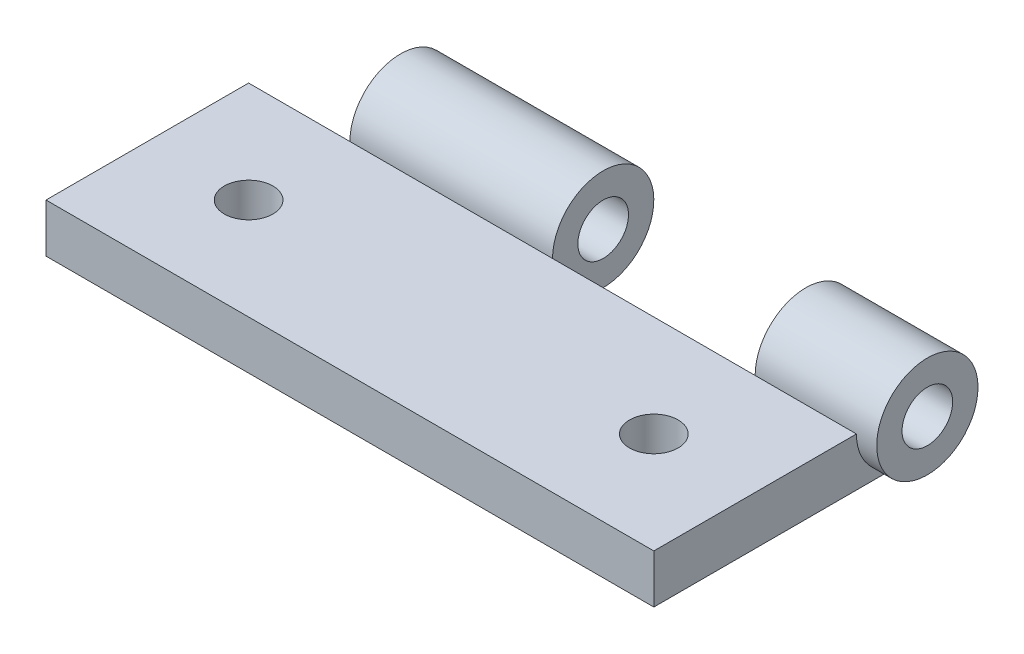
ISO-10303-21;
HEADER;
FILE_DESCRIPTION(('STEP AP214'),'2;1');
FILE_NAME('part.step','',(''),(''),'','','');
FILE_SCHEMA(('AUTOMOTIVE_DESIGN { 1 0 10303 214 1 1 1 1 }'));
ENDSEC;
DATA;
#1=APPLICATION_CONTEXT('core data for automotive mechanical design processes');
#2=APPLICATION_PROTOCOL_DEFINITION('international standard','automotive_design',2000,#1);
#3=PRODUCT_CONTEXT('',#1,'mechanical');
#4=PRODUCT('Part','Part','',(#3));
#5=PRODUCT_RELATED_PRODUCT_CATEGORY('part','',(#4));
#6=PRODUCT_DEFINITION_FORMATION('','',#4);
#7=PRODUCT_DEFINITION_CONTEXT('part definition',#1,'design');
#8=PRODUCT_DEFINITION('design','',#6,#7);
#9=PRODUCT_DEFINITION_SHAPE('','',#8);
#10=(LENGTH_UNIT() NAMED_UNIT(*) SI_UNIT(.MILLI.,.METRE.));
#11=(NAMED_UNIT(*) PLANE_ANGLE_UNIT() SI_UNIT($,.RADIAN.));
#12=(NAMED_UNIT(*) SI_UNIT($,.STERADIAN.) SOLID_ANGLE_UNIT());
#13=UNCERTAINTY_MEASURE_WITH_UNIT(LENGTH_MEASURE(1.E-05),#10,'distance_accuracy_value','');
#14=(GEOMETRIC_REPRESENTATION_CONTEXT(3) GLOBAL_UNCERTAINTY_ASSIGNED_CONTEXT((#13)) GLOBAL_UNIT_ASSIGNED_CONTEXT((#10,
#11,#12)) REPRESENTATION_CONTEXT('',''));
#15=CARTESIAN_POINT('',(0.,0.,0.));
#16=DIRECTION('',(0.,0.,1.));
#17=DIRECTION('',(1.,0.,0.));
#18=AXIS2_PLACEMENT_3D('',#15,#16,#17);
#19=CARTESIAN_POINT('',(0.,0.,0.));
#20=DIRECTION('',(0.,-1.,0.));
#21=DIRECTION('',(0.,0.,-1.));
#22=AXIS2_PLACEMENT_3D('',#19,#20,#21);
#23=PLANE('',#22);
#24=CARTESIAN_POINT('',(12.7,0.,1.5875));
#25=DIRECTION('',(0.,-1.,0.));
#26=DIRECTION('',(0.,0.,-1.));
#27=AXIS2_PLACEMENT_3D('',#24,#25,#26);
#28=CIRCLE('',#27,1.524);
#29=CARTESIAN_POINT('',(12.7,0.,0.0635000000000015));
#30=VERTEX_POINT('',#29);
#31=EDGE_CURVE('E178',#30,#30,#28,.T.);
#32=ORIENTED_EDGE('',*,*,#31,.F.);
#33=EDGE_LOOP('',(#32));
#34=FACE_BOUND('',#33,.T.);
#35=CARTESIAN_POINT('',(-12.7,0.,1.5875));
#36=DIRECTION('',(0.,-1.,0.));
#37=DIRECTION('',(0.,0.,-1.));
#38=AXIS2_PLACEMENT_3D('',#35,#36,#37);
#39=CIRCLE('',#38,1.524);
#40=CARTESIAN_POINT('',(-12.7,0.,0.0635));
#41=VERTEX_POINT('',#40);
#42=EDGE_CURVE('E172',#41,#41,#39,.T.);
#43=ORIENTED_EDGE('',*,*,#42,.F.);
#44=EDGE_LOOP('',(#43));
#45=FACE_BOUND('',#44,.T.);
#46=DIRECTION('',(1.,0.,0.));
#47=VECTOR('',#46,1.);
#48=CARTESIAN_POINT('',(-20.32,0.,-7.04849999999999));
#49=LINE('',#48,#47);
#50=CARTESIAN_POINT('',(0.,0.,-7.0485));
#51=VERTEX_POINT('',#50);
#52=CARTESIAN_POINT('',(-12.7,0.,-7.0485));
#53=VERTEX_POINT('',#52);
#54=EDGE_CURVE('E246',#51,#53,#49,.F.);
#55=ORIENTED_EDGE('',*,*,#54,.F.);
#56=DIRECTION('',(0.,0.,1.));
#57=VECTOR('',#56,1.);
#58=CARTESIAN_POINT('',(0.,0.,0.));
#59=LINE('',#58,#57);
#60=CARTESIAN_POINT('',(0.,0.,-4.7625));
#61=VERTEX_POINT('',#60);
#62=EDGE_CURVE('E157',#51,#61,#59,.T.);
#63=ORIENTED_EDGE('',*,*,#62,.T.);
#64=DIRECTION('',(-1.,0.,0.));
#65=VECTOR('',#64,1.);
#66=CARTESIAN_POINT('',(0.,0.,-4.7625));
#67=LINE('',#66,#65);
#68=CARTESIAN_POINT('',(12.7,0.,-4.7625));
#69=VERTEX_POINT('',#68);
#70=EDGE_CURVE('E160',#69,#61,#67,.T.);
#71=ORIENTED_EDGE('',*,*,#70,.F.);
#72=DIRECTION('',(0.,0.,1.));
#73=VECTOR('',#72,1.);
#74=CARTESIAN_POINT('',(12.7,0.,0.));
#75=LINE('',#74,#73);
#76=CARTESIAN_POINT('',(12.7,0.,-7.0485));
#77=VERTEX_POINT('',#76);
#78=EDGE_CURVE('E129',#77,#69,#75,.T.);
#79=ORIENTED_EDGE('',*,*,#78,.F.);
#80=CARTESIAN_POINT('',(19.05,0.,-7.0485));
#81=VERTEX_POINT('',#80);
#82=EDGE_CURVE('E58',#81,#77,#49,.F.);
#83=ORIENTED_EDGE('',*,*,#82,.F.);
#84=DIRECTION('',(0.,0.,-1.));
#85=VECTOR('',#84,1.);
#86=CARTESIAN_POINT('',(19.05,0.,7.9375));
#87=LINE('',#86,#85);
#88=CARTESIAN_POINT('',(19.05,0.,7.9375));
#89=VERTEX_POINT('',#88);
#90=EDGE_CURVE('E134',#89,#81,#87,.T.);
#91=ORIENTED_EDGE('',*,*,#90,.F.);
#92=DIRECTION('',(1.,0.,0.));
#93=VECTOR('',#92,1.);
#94=CARTESIAN_POINT('',(-19.05,0.,7.9375));
#95=LINE('',#94,#93);
#96=CARTESIAN_POINT('',(-19.05,0.,7.9375));
#97=VERTEX_POINT('',#96);
#98=EDGE_CURVE('E239',#97,#89,#95,.T.);
#99=ORIENTED_EDGE('',*,*,#98,.F.);
#100=DIRECTION('',(0.,0.,1.));
#101=VECTOR('',#100,1.);
#102=CARTESIAN_POINT('',(-19.05,0.,7.9375));
#103=LINE('',#102,#101);
#104=CARTESIAN_POINT('',(-19.05,0.,-4.7625));
#105=VERTEX_POINT('',#104);
#106=EDGE_CURVE('E135',#105,#97,#103,.T.);
#107=ORIENTED_EDGE('',*,*,#106,.F.);
#108=DIRECTION('',(-1.,0.,0.));
#109=VECTOR('',#108,1.);
#110=CARTESIAN_POINT('',(0.,0.,-4.76250000000001));
#111=LINE('',#110,#109);
#112=CARTESIAN_POINT('',(-12.7,0.,-4.7625));
#113=VERTEX_POINT('',#112);
#114=EDGE_CURVE('E147',#113,#105,#111,.T.);
#115=ORIENTED_EDGE('',*,*,#114,.F.);
#116=DIRECTION('',(0.,0.,1.));
#117=VECTOR('',#116,1.);
#118=CARTESIAN_POINT('',(-12.7,0.,0.));
#119=LINE('',#118,#117);
#120=EDGE_CURVE('E143',#53,#113,#119,.T.);
#121=ORIENTED_EDGE('',*,*,#120,.F.);
#122=EDGE_LOOP('',(#55,#63,#71,#79,#83,#91,#99,#107,#115,#121));
#123=FACE_BOUND('',#122,.T.);
#124=ADVANCED_FACE('F34',(#34,#45,#123),#23,.T.);
#125=CARTESIAN_POINT('',(-20.32,3.048,-7.9375));
#126=DIRECTION('',(1.,0.,0.));
#127=DIRECTION('',(0.,0.,-1.));
#128=AXIS2_PLACEMENT_3D('',#125,#126,#127);
#129=CYLINDRICAL_SURFACE('',#128,3.175);
#130=DIRECTION('',(1.,0.,0.));
#131=VECTOR('',#130,1.);
#132=CARTESIAN_POINT('',(-20.32,3.048,-4.7625));
#133=LINE('',#132,#131);
#134=CARTESIAN_POINT('',(0.,3.048,-4.7625));
#135=VERTEX_POINT('',#134);
#136=CARTESIAN_POINT('',(-12.7,3.048,-4.7625));
#137=VERTEX_POINT('',#136);
#138=EDGE_CURVE('E126',#135,#137,#133,.F.);
#139=ORIENTED_EDGE('',*,*,#138,.F.);
#140=CARTESIAN_POINT('',(0.,3.048,-7.9375));
#141=DIRECTION('',(1.,0.,0.));
#142=DIRECTION('',(0.,0.,-1.));
#143=AXIS2_PLACEMENT_3D('',#140,#141,#142);
#144=CIRCLE('',#143,3.175);
#145=EDGE_CURVE('E11',#135,#51,#144,.F.);
#146=ORIENTED_EDGE('',*,*,#145,.T.);
#147=ORIENTED_EDGE('',*,*,#54,.T.);
#148=CARTESIAN_POINT('',(-12.7,3.048,-7.9375));
#149=DIRECTION('',(1.,0.,0.));
#150=DIRECTION('',(0.,0.,-1.));
#151=AXIS2_PLACEMENT_3D('',#148,#149,#150);
#152=CIRCLE('',#151,3.175);
#153=EDGE_CURVE('E112',#137,#53,#152,.F.);
#154=ORIENTED_EDGE('',*,*,#153,.F.);
#155=EDGE_LOOP('',(#139,#146,#147,#154));
#156=FACE_BOUND('',#155,.T.);
#157=ADVANCED_FACE('F209',(#156),#129,.T.);
#158=CARTESIAN_POINT('',(12.7,3.048,-7.9375));
#159=DIRECTION('',(1.,0.,0.));
#160=DIRECTION('',(0.,0.,-1.));
#161=AXIS2_PLACEMENT_3D('',#158,#159,#160);
#162=CIRCLE('',#161,3.175);
#163=CARTESIAN_POINT('',(12.7,3.048,-4.7625));
#164=VERTEX_POINT('',#163);
#165=EDGE_CURVE('E43',#164,#77,#162,.F.);
#166=ORIENTED_EDGE('',*,*,#165,.F.);
#167=CARTESIAN_POINT('',(19.05,3.048,-4.7625));
#168=VERTEX_POINT('',#167);
#169=EDGE_CURVE('E109',#168,#164,#133,.F.);
#170=ORIENTED_EDGE('',*,*,#169,.F.);
#171=CARTESIAN_POINT('',(19.05,3.048,-7.9375));
#172=DIRECTION('',(-1.,0.,0.));
#173=DIRECTION('',(0.,0.,1.));
#174=AXIS2_PLACEMENT_3D('',#171,#172,#173);
#175=CIRCLE('',#174,3.175);
#176=EDGE_CURVE('E50',#81,#168,#175,.T.);
#177=ORIENTED_EDGE('',*,*,#176,.F.);
#178=ORIENTED_EDGE('',*,*,#82,.T.);
#179=EDGE_LOOP('',(#166,#170,#177,#178));
#180=FACE_BOUND('',#179,.T.);
#181=CARTESIAN_POINT('',(20.32,3.048,-7.9375));
#182=DIRECTION('',(1.,0.,0.));
#183=DIRECTION('',(0.,0.,-1.));
#184=AXIS2_PLACEMENT_3D('',#181,#182,#183);
#185=CIRCLE('',#184,3.175);
#186=CARTESIAN_POINT('',(20.32,3.048,-11.1125));
#187=VERTEX_POINT('',#186);
#188=EDGE_CURVE('E141',#187,#187,#185,.T.);
#189=ORIENTED_EDGE('',*,*,#188,.F.);
#190=EDGE_LOOP('',(#189));
#191=FACE_BOUND('',#190,.T.);
#192=ADVANCED_FACE('F106',(#180,#191),#129,.T.);
#193=CARTESIAN_POINT('',(19.05,3.048,7.9375));
#194=DIRECTION('',(-1.,0.,0.));
#195=DIRECTION('',(0.,0.,1.));
#196=AXIS2_PLACEMENT_3D('',#193,#194,#195);
#197=PLANE('',#196);
#198=ORIENTED_EDGE('',*,*,#90,.T.);
#199=ORIENTED_EDGE('',*,*,#176,.T.);
#200=DIRECTION('',(0.,0.,-1.));
#201=VECTOR('',#200,1.);
#202=CARTESIAN_POINT('',(19.05,3.048,7.9375));
#203=LINE('',#202,#201);
#204=CARTESIAN_POINT('',(19.05,3.048,7.9375));
#205=VERTEX_POINT('',#204);
#206=EDGE_CURVE('E133',#205,#168,#203,.T.);
#207=ORIENTED_EDGE('',*,*,#206,.F.);
#208=DIRECTION('',(0.,-1.,0.));
#209=VECTOR('',#208,1.);
#210=CARTESIAN_POINT('',(19.05,3.048,7.9375));
#211=LINE('',#210,#209);
#212=EDGE_CURVE('E237',#205,#89,#211,.T.);
#213=ORIENTED_EDGE('',*,*,#212,.T.);
#214=EDGE_LOOP('',(#198,#199,#207,#213));
#215=FACE_BOUND('',#214,.T.);
#216=ADVANCED_FACE('F36',(#215),#197,.F.);
#217=CARTESIAN_POINT('',(-19.05,3.048,7.9375));
#218=DIRECTION('',(1.,0.,0.));
#219=DIRECTION('',(0.,0.,-1.));
#220=AXIS2_PLACEMENT_3D('',#217,#218,#219);
#221=PLANE('',#220);
#222=DIRECTION('',(0.,0.,1.));
#223=VECTOR('',#222,1.);
#224=CARTESIAN_POINT('',(-19.05,3.048,7.9375));
#225=LINE('',#224,#223);
#226=CARTESIAN_POINT('',(-19.05,3.048,-4.7625));
#227=VERTEX_POINT('',#226);
#228=CARTESIAN_POINT('',(-19.05,3.048,7.9375));
#229=VERTEX_POINT('',#228);
#230=EDGE_CURVE('E230',#227,#229,#225,.T.);
#231=ORIENTED_EDGE('',*,*,#230,.F.);
#232=DIRECTION('',(0.,-1.,0.));
#233=VECTOR('',#232,1.);
#234=CARTESIAN_POINT('',(-19.05,3.048,-4.7625));
#235=LINE('',#234,#233);
#236=EDGE_CURVE('E149',#227,#105,#235,.T.);
#237=ORIENTED_EDGE('',*,*,#236,.T.);
#238=ORIENTED_EDGE('',*,*,#106,.T.);
#239=DIRECTION('',(0.,-1.,0.));
#240=VECTOR('',#239,1.);
#241=CARTESIAN_POINT('',(-19.05,3.048,7.9375));
#242=LINE('',#241,#240);
#243=EDGE_CURVE('E233',#229,#97,#242,.T.);
#244=ORIENTED_EDGE('',*,*,#243,.F.);
#245=EDGE_LOOP('',(#231,#237,#238,#244));
#246=FACE_BOUND('',#245,.T.);
#247=ADVANCED_FACE('F221',(#246),#221,.F.);
#248=CARTESIAN_POINT('',(-19.05,3.048,7.9375));
#249=DIRECTION('',(0.,0.,-1.));
#250=DIRECTION('',(-1.,0.,0.));
#251=AXIS2_PLACEMENT_3D('',#248,#249,#250);
#252=PLANE('',#251);
#253=ORIENTED_EDGE('',*,*,#98,.T.);
#254=ORIENTED_EDGE('',*,*,#212,.F.);
#255=DIRECTION('',(1.,0.,0.));
#256=VECTOR('',#255,1.);
#257=CARTESIAN_POINT('',(-19.05,3.048,7.9375));
#258=LINE('',#257,#256);
#259=EDGE_CURVE('E235',#229,#205,#258,.T.);
#260=ORIENTED_EDGE('',*,*,#259,.F.);
#261=ORIENTED_EDGE('',*,*,#243,.T.);
#262=EDGE_LOOP('',(#253,#254,#260,#261));
#263=FACE_BOUND('',#262,.T.);
#264=ADVANCED_FACE('F190',(#263),#252,.F.);
#265=CARTESIAN_POINT('',(0.,3.048,0.));
#266=DIRECTION('',(0.,-1.,0.));
#267=DIRECTION('',(0.,0.,-1.));
#268=AXIS2_PLACEMENT_3D('',#265,#266,#267);
#269=PLANE('',#268);
#270=CARTESIAN_POINT('',(12.7,3.048,1.5875));
#271=DIRECTION('',(0.,1.,0.));
#272=DIRECTION('',(0.,0.,1.));
#273=AXIS2_PLACEMENT_3D('',#270,#271,#272);
#274=CIRCLE('',#273,1.524);
#275=CARTESIAN_POINT('',(12.7,3.048,3.1115));
#276=VERTEX_POINT('',#275);
#277=EDGE_CURVE('E181',#276,#276,#274,.T.);
#278=ORIENTED_EDGE('',*,*,#277,.F.);
#279=EDGE_LOOP('',(#278));
#280=FACE_BOUND('',#279,.T.);
#281=CARTESIAN_POINT('',(-12.7,3.048,1.5875));
#282=DIRECTION('',(0.,1.,0.));
#283=DIRECTION('',(0.,0.,1.));
#284=AXIS2_PLACEMENT_3D('',#281,#282,#283);
#285=CIRCLE('',#284,1.524);
#286=CARTESIAN_POINT('',(-12.7,3.048,3.1115));
#287=VERTEX_POINT('',#286);
#288=EDGE_CURVE('E175',#287,#287,#285,.T.);
#289=ORIENTED_EDGE('',*,*,#288,.F.);
#290=EDGE_LOOP('',(#289));
#291=FACE_BOUND('',#290,.T.);
#292=ORIENTED_EDGE('',*,*,#206,.T.);
#293=ORIENTED_EDGE('',*,*,#169,.T.);
#294=EDGE_CURVE('E118',#164,#135,#133,.F.);
#295=ORIENTED_EDGE('',*,*,#294,.T.);
#296=ORIENTED_EDGE('',*,*,#138,.T.);
#297=DIRECTION('',(1.,0.,0.));
#298=VECTOR('',#297,1.);
#299=CARTESIAN_POINT('',(-20.32,3.048,-4.7625));
#300=LINE('',#299,#298);
#301=EDGE_CURVE('E152',#137,#227,#300,.F.);
#302=ORIENTED_EDGE('',*,*,#301,.T.);
#303=ORIENTED_EDGE('',*,*,#230,.T.);
#304=ORIENTED_EDGE('',*,*,#259,.T.);
#305=EDGE_LOOP('',(#292,#293,#295,#296,#302,#303,#304));
#306=FACE_BOUND('',#305,.T.);
#307=ADVANCED_FACE('F132',(#280,#291,#306),#269,.F.);
#308=CARTESIAN_POINT('',(20.32,3.048,-7.9375));
#309=DIRECTION('',(1.,0.,0.));
#310=DIRECTION('',(0.,0.,-1.));
#311=AXIS2_PLACEMENT_3D('',#308,#309,#310);
#312=PLANE('',#311);
#313=CARTESIAN_POINT('',(20.32,3.048,-7.9375));
#314=DIRECTION('',(1.,0.,0.));
#315=DIRECTION('',(0.,0.,-1.));
#316=AXIS2_PLACEMENT_3D('',#313,#314,#315);
#317=CIRCLE('',#316,1.5875);
#318=CARTESIAN_POINT('',(20.32,3.048,-9.525));
#319=VERTEX_POINT('',#318);
#320=EDGE_CURVE('E169',#319,#319,#317,.T.);
#321=ORIENTED_EDGE('',*,*,#320,.F.);
#322=EDGE_LOOP('',(#321));
#323=FACE_BOUND('',#322,.T.);
#324=ORIENTED_EDGE('',*,*,#188,.T.);
#325=EDGE_LOOP('',(#324));
#326=FACE_BOUND('',#325,.T.);
#327=ADVANCED_FACE('F189',(#323,#326),#312,.T.);
#328=CARTESIAN_POINT('',(-12.7,6.223,-4.7625));
#329=DIRECTION('',(0.,0.,1.));
#330=DIRECTION('',(1.,0.,0.));
#331=AXIS2_PLACEMENT_3D('',#328,#329,#330);
#332=PLANE('',#331);
#333=ORIENTED_EDGE('',*,*,#114,.T.);
#334=ORIENTED_EDGE('',*,*,#236,.F.);
#335=ORIENTED_EDGE('',*,*,#301,.F.);
#336=DIRECTION('',(0.,-1.,0.));
#337=VECTOR('',#336,1.);
#338=CARTESIAN_POINT('',(-12.7,6.223,-4.7625));
#339=LINE('',#338,#337);
#340=EDGE_CURVE('E154',#137,#113,#339,.T.);
#341=ORIENTED_EDGE('',*,*,#340,.T.);
#342=EDGE_LOOP('',(#333,#334,#335,#341));
#343=FACE_BOUND('',#342,.T.);
#344=ADVANCED_FACE('F258',(#343),#332,.F.);
#345=CARTESIAN_POINT('',(-12.7,6.223,-11.1125));
#346=DIRECTION('',(1.,0.,0.));
#347=DIRECTION('',(0.,0.,-1.));
#348=AXIS2_PLACEMENT_3D('',#345,#346,#347);
#349=PLANE('',#348);
#350=CARTESIAN_POINT('',(-12.7,3.048,-7.9375));
#351=DIRECTION('',(1.,0.,0.));
#352=DIRECTION('',(0.,0.,-1.));
#353=AXIS2_PLACEMENT_3D('',#350,#351,#352);
#354=CIRCLE('',#353,1.5875);
#355=CARTESIAN_POINT('',(-12.7,3.048,-9.525));
#356=VERTEX_POINT('',#355);
#357=EDGE_CURVE('E130',#356,#356,#354,.T.);
#358=ORIENTED_EDGE('',*,*,#357,.T.);
#359=EDGE_LOOP('',(#358));
#360=FACE_BOUND('',#359,.T.);
#361=ORIENTED_EDGE('',*,*,#120,.T.);
#362=ORIENTED_EDGE('',*,*,#340,.F.);
#363=ORIENTED_EDGE('',*,*,#153,.T.);
#364=EDGE_LOOP('',(#361,#362,#363));
#365=FACE_BOUND('',#364,.T.);
#366=ADVANCED_FACE('F252',(#360,#365),#349,.F.);
#367=CARTESIAN_POINT('',(12.7,6.223,-4.7625));
#368=DIRECTION('',(0.,0.,1.));
#369=DIRECTION('',(1.,0.,0.));
#370=AXIS2_PLACEMENT_3D('',#367,#368,#369);
#371=PLANE('',#370);
#372=ORIENTED_EDGE('',*,*,#70,.T.);
#373=DIRECTION('',(0.,-1.,0.));
#374=VECTOR('',#373,1.);
#375=CARTESIAN_POINT('',(0.,6.223,-4.7625));
#376=LINE('',#375,#374);
#377=EDGE_CURVE('E123',#135,#61,#376,.T.);
#378=ORIENTED_EDGE('',*,*,#377,.F.);
#379=ORIENTED_EDGE('',*,*,#294,.F.);
#380=DIRECTION('',(0.,-1.,0.));
#381=VECTOR('',#380,1.);
#382=CARTESIAN_POINT('',(12.7,6.223,-4.7625));
#383=LINE('',#382,#381);
#384=EDGE_CURVE('E120',#164,#69,#383,.T.);
#385=ORIENTED_EDGE('',*,*,#384,.T.);
#386=EDGE_LOOP('',(#372,#378,#379,#385));
#387=FACE_BOUND('',#386,.T.);
#388=ADVANCED_FACE('F119',(#387),#371,.F.);
#389=CARTESIAN_POINT('',(0.,6.223,-11.1125));
#390=DIRECTION('',(1.,0.,0.));
#391=DIRECTION('',(0.,0.,-1.));
#392=AXIS2_PLACEMENT_3D('',#389,#390,#391);
#393=PLANE('',#392);
#394=CARTESIAN_POINT('',(0.,3.048,-7.9375));
#395=DIRECTION('',(1.,0.,0.));
#396=DIRECTION('',(0.,0.,-1.));
#397=AXIS2_PLACEMENT_3D('',#394,#395,#396);
#398=CIRCLE('',#397,1.5875);
#399=CARTESIAN_POINT('',(0.,3.048,-9.525));
#400=VERTEX_POINT('',#399);
#401=EDGE_CURVE('E166',#400,#400,#398,.T.);
#402=ORIENTED_EDGE('',*,*,#401,.F.);
#403=EDGE_LOOP('',(#402));
#404=FACE_BOUND('',#403,.T.);
#405=ORIENTED_EDGE('',*,*,#145,.F.);
#406=ORIENTED_EDGE('',*,*,#377,.T.);
#407=ORIENTED_EDGE('',*,*,#62,.F.);
#408=EDGE_LOOP('',(#405,#406,#407));
#409=FACE_BOUND('',#408,.T.);
#410=ADVANCED_FACE('F270',(#404,#409),#393,.T.);
#411=CARTESIAN_POINT('',(12.7,6.223,-11.1125));
#412=DIRECTION('',(1.,0.,0.));
#413=DIRECTION('',(0.,0.,-1.));
#414=AXIS2_PLACEMENT_3D('',#411,#412,#413);
#415=PLANE('',#414);
#416=CARTESIAN_POINT('',(12.7,3.048,-7.9375));
#417=DIRECTION('',(1.,0.,0.));
#418=DIRECTION('',(0.,0.,-1.));
#419=AXIS2_PLACEMENT_3D('',#416,#417,#418);
#420=CIRCLE('',#419,1.5875);
#421=CARTESIAN_POINT('',(12.7,3.048,-9.525));
#422=VERTEX_POINT('',#421);
#423=EDGE_CURVE('E38',#422,#422,#420,.T.);
#424=ORIENTED_EDGE('',*,*,#423,.T.);
#425=EDGE_LOOP('',(#424));
#426=FACE_BOUND('',#425,.T.);
#427=ORIENTED_EDGE('',*,*,#78,.T.);
#428=ORIENTED_EDGE('',*,*,#384,.F.);
#429=ORIENTED_EDGE('',*,*,#165,.T.);
#430=EDGE_LOOP('',(#427,#428,#429));
#431=FACE_BOUND('',#430,.T.);
#432=ADVANCED_FACE('F128',(#426,#431),#415,.F.);
#433=CARTESIAN_POINT('',(-19.05,3.048,-7.9375));
#434=DIRECTION('',(1.,0.,0.));
#435=DIRECTION('',(0.,0.,-1.));
#436=AXIS2_PLACEMENT_3D('',#433,#434,#435);
#437=CYLINDRICAL_SURFACE('',#436,1.5875);
#438=ORIENTED_EDGE('',*,*,#320,.T.);
#439=EDGE_LOOP('',(#438));
#440=FACE_BOUND('',#439,.T.);
#441=ORIENTED_EDGE('',*,*,#423,.F.);
#442=EDGE_LOOP('',(#441));
#443=FACE_BOUND('',#442,.T.);
#444=ADVANCED_FACE('F205',(#440,#443),#437,.F.);
#445=ORIENTED_EDGE('',*,*,#401,.T.);
#446=EDGE_LOOP('',(#445));
#447=FACE_BOUND('',#446,.T.);
#448=ORIENTED_EDGE('',*,*,#357,.F.);
#449=EDGE_LOOP('',(#448));
#450=FACE_BOUND('',#449,.T.);
#451=ADVANCED_FACE('F196',(#447,#450),#437,.F.);
#452=CARTESIAN_POINT('',(-12.7,-0.127000000000001,1.5875));
#453=DIRECTION('',(0.,1.,0.));
#454=DIRECTION('',(0.,0.,1.));
#455=AXIS2_PLACEMENT_3D('',#452,#453,#454);
#456=CYLINDRICAL_SURFACE('',#455,1.524);
#457=ORIENTED_EDGE('',*,*,#42,.T.);
#458=EDGE_LOOP('',(#457));
#459=FACE_BOUND('',#458,.T.);
#460=ORIENTED_EDGE('',*,*,#288,.T.);
#461=EDGE_LOOP('',(#460));
#462=FACE_BOUND('',#461,.T.);
#463=ADVANCED_FACE('F194',(#459,#462),#456,.F.);
#464=CARTESIAN_POINT('',(12.7,-0.127000000000001,1.5875));
#465=DIRECTION('',(0.,1.,0.));
#466=DIRECTION('',(0.,0.,1.));
#467=AXIS2_PLACEMENT_3D('',#464,#465,#466);
#468=CYLINDRICAL_SURFACE('',#467,1.524);
#469=ORIENTED_EDGE('',*,*,#31,.T.);
#470=EDGE_LOOP('',(#469));
#471=FACE_BOUND('',#470,.T.);
#472=ORIENTED_EDGE('',*,*,#277,.T.);
#473=EDGE_LOOP('',(#472));
#474=FACE_BOUND('',#473,.T.);
#475=ADVANCED_FACE('F185',(#471,#474),#468,.F.);
#476=CLOSED_SHELL('',(#124,#157,#192,#216,#247,#264,#307,#327,#344,#366,#388,#410,#432,#444,
#451,#463,#475));
#477=MANIFOLD_SOLID_BREP('B2',#476);
#478=ADVANCED_BREP_SHAPE_REPRESENTATION('',(#18,#477),#14);
#479=SHAPE_DEFINITION_REPRESENTATION(#9,#478);
ENDSEC;
END-ISO-10303-21;
